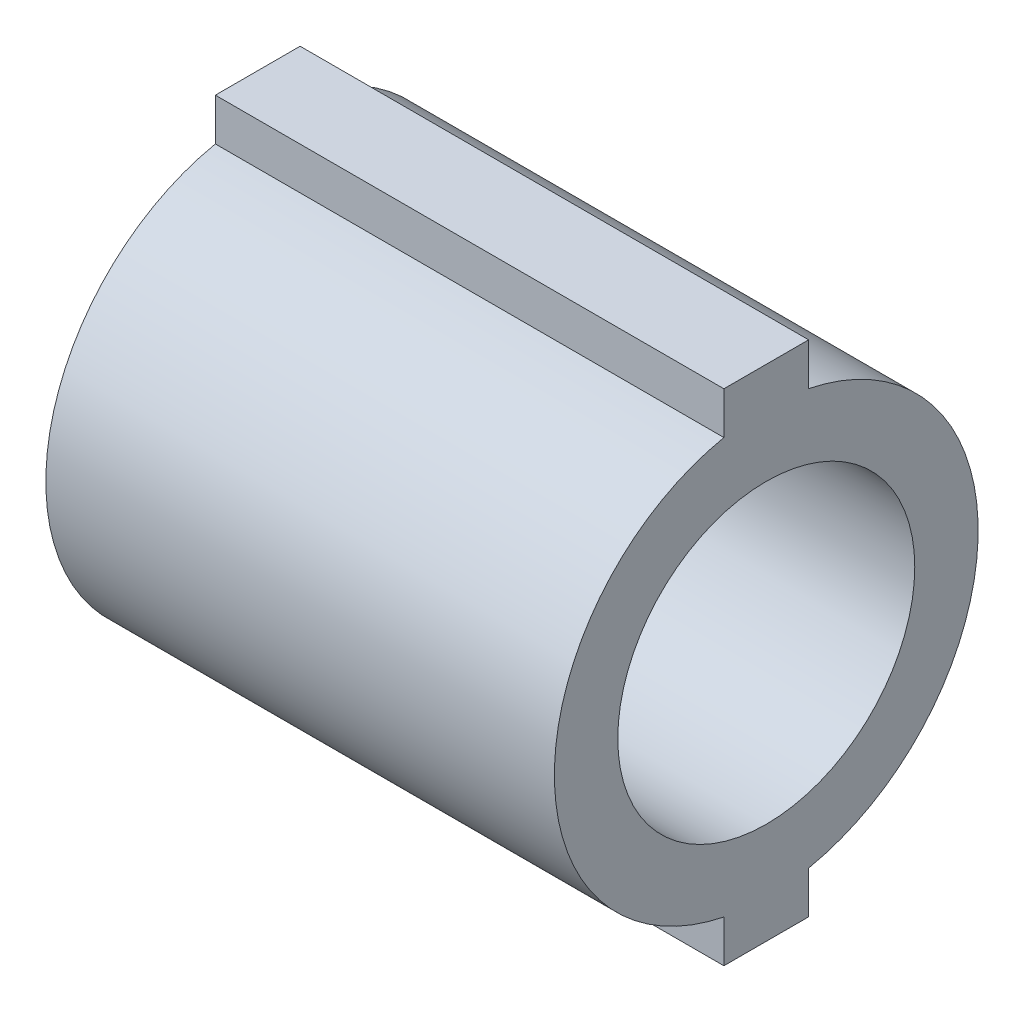
ISO-10303-21;
HEADER;
FILE_DESCRIPTION(('STEP AP214'),'2;1');
FILE_NAME('part.step','',(''),(''),'','','');
FILE_SCHEMA(('AUTOMOTIVE_DESIGN { 1 0 10303 214 1 1 1 1 }'));
ENDSEC;
DATA;
#1=APPLICATION_CONTEXT('core data for automotive mechanical design processes');
#2=APPLICATION_PROTOCOL_DEFINITION('international standard','automotive_design',2000,#1);
#3=PRODUCT_CONTEXT('',#1,'mechanical');
#4=PRODUCT('Part','Part','',(#3));
#5=PRODUCT_RELATED_PRODUCT_CATEGORY('part','',(#4));
#6=PRODUCT_DEFINITION_FORMATION('','',#4);
#7=PRODUCT_DEFINITION_CONTEXT('part definition',#1,'design');
#8=PRODUCT_DEFINITION('design','',#6,#7);
#9=PRODUCT_DEFINITION_SHAPE('','',#8);
#10=(LENGTH_UNIT() NAMED_UNIT(*) SI_UNIT(.MILLI.,.METRE.));
#11=(NAMED_UNIT(*) PLANE_ANGLE_UNIT() SI_UNIT($,.RADIAN.));
#12=(NAMED_UNIT(*) SI_UNIT($,.STERADIAN.) SOLID_ANGLE_UNIT());
#13=UNCERTAINTY_MEASURE_WITH_UNIT(LENGTH_MEASURE(1.E-05),#10,'distance_accuracy_value','');
#14=(GEOMETRIC_REPRESENTATION_CONTEXT(3) GLOBAL_UNCERTAINTY_ASSIGNED_CONTEXT((#13)) GLOBAL_UNIT_ASSIGNED_CONTEXT((#10,
#11,#12)) REPRESENTATION_CONTEXT('',''));
#15=CARTESIAN_POINT('',(0.,0.,0.));
#16=DIRECTION('',(0.,0.,1.));
#17=DIRECTION('',(1.,0.,0.));
#18=AXIS2_PLACEMENT_3D('',#15,#16,#17);
#19=CARTESIAN_POINT('',(19.05,0.,0.));
#20=DIRECTION('',(-1.,0.,0.));
#21=DIRECTION('',(0.,0.,1.));
#22=AXIS2_PLACEMENT_3D('',#19,#20,#21);
#23=CYLINDRICAL_SURFACE('',#22,7.9375);
#24=CARTESIAN_POINT('',(0.,0.,0.));
#25=DIRECTION('',(1.,0.,0.));
#26=DIRECTION('',(0.,0.,-1.));
#27=AXIS2_PLACEMENT_3D('',#24,#25,#26);
#28=CIRCLE('',#27,7.9375);
#29=CARTESIAN_POINT('',(0.,7.77712993333659,1.5875));
#30=VERTEX_POINT('',#29);
#31=CARTESIAN_POINT('',(0.,-7.77712993333659,1.5875));
#32=VERTEX_POINT('',#31);
#33=EDGE_CURVE('E37',#30,#32,#28,.T.);
#34=ORIENTED_EDGE('',*,*,#33,.T.);
#35=DIRECTION('',(-1.,0.,0.));
#36=VECTOR('',#35,1.);
#37=CARTESIAN_POINT('',(19.05,-7.77712993333659,1.5875));
#38=LINE('',#37,#36);
#39=CARTESIAN_POINT('',(19.05,-7.77712993333659,1.5875));
#40=VERTEX_POINT('',#39);
#41=EDGE_CURVE('E130',#32,#40,#38,.F.);
#42=ORIENTED_EDGE('',*,*,#41,.T.);
#43=CARTESIAN_POINT('',(19.05,0.,0.));
#44=DIRECTION('',(1.,0.,0.));
#45=DIRECTION('',(0.,0.,-1.));
#46=AXIS2_PLACEMENT_3D('',#43,#44,#45);
#47=CIRCLE('',#46,7.9375);
#48=CARTESIAN_POINT('',(19.05,7.77712993333659,1.5875));
#49=VERTEX_POINT('',#48);
#50=EDGE_CURVE('E11',#49,#40,#47,.T.);
#51=ORIENTED_EDGE('',*,*,#50,.F.);
#52=DIRECTION('',(-1.,0.,0.));
#53=VECTOR('',#52,1.);
#54=CARTESIAN_POINT('',(19.05,7.77712993333659,1.5875));
#55=LINE('',#54,#53);
#56=EDGE_CURVE('E155',#49,#30,#55,.T.);
#57=ORIENTED_EDGE('',*,*,#56,.T.);
#58=EDGE_LOOP('',(#34,#42,#51,#57));
#59=FACE_BOUND('',#58,.T.);
#60=ADVANCED_FACE('F33',(#59),#23,.T.);
#61=CARTESIAN_POINT('',(19.05,-7.77712993333659,-1.5875));
#62=VERTEX_POINT('',#61);
#63=CARTESIAN_POINT('',(19.05,7.77712993333659,-1.5875));
#64=VERTEX_POINT('',#63);
#65=EDGE_CURVE('E42',#62,#64,#47,.T.);
#66=ORIENTED_EDGE('',*,*,#65,.F.);
#67=DIRECTION('',(-1.,0.,0.));
#68=VECTOR('',#67,1.);
#69=CARTESIAN_POINT('',(19.05,-7.77712993333659,-1.5875));
#70=LINE('',#69,#68);
#71=CARTESIAN_POINT('',(0.,-7.77712993333659,-1.5875));
#72=VERTEX_POINT('',#71);
#73=EDGE_CURVE('E128',#62,#72,#70,.T.);
#74=ORIENTED_EDGE('',*,*,#73,.T.);
#75=CARTESIAN_POINT('',(0.,7.77712993333659,-1.5875));
#76=VERTEX_POINT('',#75);
#77=EDGE_CURVE('E157',#72,#76,#28,.T.);
#78=ORIENTED_EDGE('',*,*,#77,.T.);
#79=DIRECTION('',(-1.,0.,0.));
#80=VECTOR('',#79,1.);
#81=CARTESIAN_POINT('',(19.05,7.77712993333659,-1.5875));
#82=LINE('',#81,#80);
#83=EDGE_CURVE('E143',#76,#64,#82,.F.);
#84=ORIENTED_EDGE('',*,*,#83,.T.);
#85=EDGE_LOOP('',(#66,#74,#78,#84));
#86=FACE_BOUND('',#85,.T.);
#87=ADVANCED_FACE('F35',(#86),#23,.T.);
#88=CARTESIAN_POINT('',(19.05,0.,0.));
#89=DIRECTION('',(1.,0.,0.));
#90=DIRECTION('',(0.,0.,-1.));
#91=AXIS2_PLACEMENT_3D('',#88,#89,#90);
#92=PLANE('',#91);
#93=CARTESIAN_POINT('',(19.05,0.,0.));
#94=DIRECTION('',(1.,0.,0.));
#95=DIRECTION('',(0.,0.,-1.));
#96=AXIS2_PLACEMENT_3D('',#93,#94,#95);
#97=CIRCLE('',#96,5.5626);
#98=CARTESIAN_POINT('',(19.05,0.,-5.5626));
#99=VERTEX_POINT('',#98);
#100=EDGE_CURVE('E166',#99,#99,#97,.F.);
#101=ORIENTED_EDGE('',*,*,#100,.T.);
#102=EDGE_LOOP('',(#101));
#103=FACE_BOUND('',#102,.T.);
#104=ORIENTED_EDGE('',*,*,#50,.T.);
#105=DIRECTION('',(0.,1.,0.));
#106=VECTOR('',#105,1.);
#107=CARTESIAN_POINT('',(19.05,-5.91298430114647,1.5875));
#108=LINE('',#107,#106);
#109=CARTESIAN_POINT('',(19.05,-9.3599,1.5875));
#110=VERTEX_POINT('',#109);
#111=EDGE_CURVE('E97',#110,#40,#108,.T.);
#112=ORIENTED_EDGE('',*,*,#111,.F.);
#113=DIRECTION('',(0.,0.,1.));
#114=VECTOR('',#113,1.);
#115=CARTESIAN_POINT('',(19.05,-9.3599,-1.5875));
#116=LINE('',#115,#114);
#117=CARTESIAN_POINT('',(19.05,-9.3599,-1.5875));
#118=VERTEX_POINT('',#117);
#119=EDGE_CURVE('E101',#118,#110,#116,.T.);
#120=ORIENTED_EDGE('',*,*,#119,.F.);
#121=DIRECTION('',(0.,-1.,0.));
#122=VECTOR('',#121,1.);
#123=CARTESIAN_POINT('',(19.05,-5.91298430114647,-1.5875));
#124=LINE('',#123,#122);
#125=EDGE_CURVE('E107',#62,#118,#124,.T.);
#126=ORIENTED_EDGE('',*,*,#125,.F.);
#127=ORIENTED_EDGE('',*,*,#65,.T.);
#128=DIRECTION('',(0.,-1.,0.));
#129=VECTOR('',#128,1.);
#130=CARTESIAN_POINT('',(19.05,5.91298430114647,-1.5875));
#131=LINE('',#130,#129);
#132=CARTESIAN_POINT('',(19.05,9.3599,-1.5875));
#133=VERTEX_POINT('',#132);
#134=EDGE_CURVE('E141',#133,#64,#131,.T.);
#135=ORIENTED_EDGE('',*,*,#134,.F.);
#136=DIRECTION('',(0.,0.,-1.));
#137=VECTOR('',#136,1.);
#138=CARTESIAN_POINT('',(19.05,9.3599,-1.5875));
#139=LINE('',#138,#137);
#140=CARTESIAN_POINT('',(19.05,9.3599,1.5875));
#141=VERTEX_POINT('',#140);
#142=EDGE_CURVE('E145',#141,#133,#139,.T.);
#143=ORIENTED_EDGE('',*,*,#142,.F.);
#144=DIRECTION('',(0.,1.,0.));
#145=VECTOR('',#144,1.);
#146=CARTESIAN_POINT('',(19.05,5.91298430114647,1.5875));
#147=LINE('',#146,#145);
#148=EDGE_CURVE('E136',#49,#141,#147,.T.);
#149=ORIENTED_EDGE('',*,*,#148,.F.);
#150=EDGE_LOOP('',(#104,#112,#120,#126,#127,#135,#143,#149));
#151=FACE_BOUND('',#150,.T.);
#152=ADVANCED_FACE('F99',(#103,#151),#92,.T.);
#153=CARTESIAN_POINT('',(0.,0.,0.));
#154=DIRECTION('',(1.,0.,0.));
#155=DIRECTION('',(0.,0.,-1.));
#156=AXIS2_PLACEMENT_3D('',#153,#154,#155);
#157=PLANE('',#156);
#158=CARTESIAN_POINT('',(0.,0.,0.));
#159=DIRECTION('',(-1.,0.,0.));
#160=DIRECTION('',(0.,0.,1.));
#161=AXIS2_PLACEMENT_3D('',#158,#159,#160);
#162=CIRCLE('',#161,5.5626);
#163=CARTESIAN_POINT('',(0.,0.,5.5626));
#164=VERTEX_POINT('',#163);
#165=EDGE_CURVE('E170',#164,#164,#162,.T.);
#166=ORIENTED_EDGE('',*,*,#165,.F.);
#167=EDGE_LOOP('',(#166));
#168=FACE_BOUND('',#167,.T.);
#169=ORIENTED_EDGE('',*,*,#77,.F.);
#170=DIRECTION('',(0.,-1.,0.));
#171=VECTOR('',#170,1.);
#172=CARTESIAN_POINT('',(0.,-5.91298430114647,-1.5875));
#173=LINE('',#172,#171);
#174=CARTESIAN_POINT('',(0.,-9.3599,-1.5875));
#175=VERTEX_POINT('',#174);
#176=EDGE_CURVE('E49',#72,#175,#173,.T.);
#177=ORIENTED_EDGE('',*,*,#176,.T.);
#178=DIRECTION('',(0.,0.,1.));
#179=VECTOR('',#178,1.);
#180=CARTESIAN_POINT('',(0.,-9.3599,-1.5875));
#181=LINE('',#180,#179);
#182=CARTESIAN_POINT('',(0.,-9.3599,1.5875));
#183=VERTEX_POINT('',#182);
#184=EDGE_CURVE('E121',#175,#183,#181,.T.);
#185=ORIENTED_EDGE('',*,*,#184,.T.);
#186=DIRECTION('',(0.,1.,0.));
#187=VECTOR('',#186,1.);
#188=CARTESIAN_POINT('',(0.,-5.91298430114647,1.5875));
#189=LINE('',#188,#187);
#190=EDGE_CURVE('E113',#183,#32,#189,.T.);
#191=ORIENTED_EDGE('',*,*,#190,.T.);
#192=ORIENTED_EDGE('',*,*,#33,.F.);
#193=DIRECTION('',(0.,1.,0.));
#194=VECTOR('',#193,1.);
#195=CARTESIAN_POINT('',(0.,5.91298430114647,1.5875));
#196=LINE('',#195,#194);
#197=CARTESIAN_POINT('',(0.,9.3599,1.5875));
#198=VERTEX_POINT('',#197);
#199=EDGE_CURVE('E137',#30,#198,#196,.T.);
#200=ORIENTED_EDGE('',*,*,#199,.T.);
#201=DIRECTION('',(0.,0.,-1.));
#202=VECTOR('',#201,1.);
#203=CARTESIAN_POINT('',(0.,9.3599,-1.5875));
#204=LINE('',#203,#202);
#205=CARTESIAN_POINT('',(0.,9.3599,-1.5875));
#206=VERTEX_POINT('',#205);
#207=EDGE_CURVE('E133',#198,#206,#204,.T.);
#208=ORIENTED_EDGE('',*,*,#207,.T.);
#209=DIRECTION('',(0.,-1.,0.));
#210=VECTOR('',#209,1.);
#211=CARTESIAN_POINT('',(0.,5.91298430114647,-1.5875));
#212=LINE('',#211,#210);
#213=EDGE_CURVE('E132',#206,#76,#212,.T.);
#214=ORIENTED_EDGE('',*,*,#213,.T.);
#215=EDGE_LOOP('',(#169,#177,#185,#191,#192,#200,#208,#214));
#216=FACE_BOUND('',#215,.T.);
#217=ADVANCED_FACE('F165',(#168,#216),#157,.F.);
#218=CARTESIAN_POINT('',(23.7363474940515,5.91298430114647,1.5875));
#219=DIRECTION('',(0.,0.,1.));
#220=DIRECTION('',(1.,0.,0.));
#221=AXIS2_PLACEMENT_3D('',#218,#219,#220);
#222=PLANE('',#221);
#223=ORIENTED_EDGE('',*,*,#56,.F.);
#224=ORIENTED_EDGE('',*,*,#148,.T.);
#225=DIRECTION('',(-1.,0.,0.));
#226=VECTOR('',#225,1.);
#227=CARTESIAN_POINT('',(23.7363474940515,9.3599,1.5875));
#228=LINE('',#227,#226);
#229=EDGE_CURVE('E148',#141,#198,#228,.T.);
#230=ORIENTED_EDGE('',*,*,#229,.T.);
#231=ORIENTED_EDGE('',*,*,#199,.F.);
#232=EDGE_LOOP('',(#223,#224,#230,#231));
#233=FACE_BOUND('',#232,.T.);
#234=ADVANCED_FACE('F178',(#233),#222,.T.);
#235=CARTESIAN_POINT('',(23.7363474940515,5.91298430114647,-1.5875));
#236=DIRECTION('',(0.,0.,-1.));
#237=DIRECTION('',(-1.,0.,0.));
#238=AXIS2_PLACEMENT_3D('',#235,#236,#237);
#239=PLANE('',#238);
#240=ORIENTED_EDGE('',*,*,#83,.F.);
#241=ORIENTED_EDGE('',*,*,#213,.F.);
#242=DIRECTION('',(-1.,0.,0.));
#243=VECTOR('',#242,1.);
#244=CARTESIAN_POINT('',(23.7363474940515,9.3599,-1.5875));
#245=LINE('',#244,#243);
#246=EDGE_CURVE('E144',#133,#206,#245,.T.);
#247=ORIENTED_EDGE('',*,*,#246,.F.);
#248=ORIENTED_EDGE('',*,*,#134,.T.);
#249=EDGE_LOOP('',(#240,#241,#247,#248));
#250=FACE_BOUND('',#249,.T.);
#251=ADVANCED_FACE('F183',(#250),#239,.T.);
#252=CARTESIAN_POINT('',(23.7363474940515,9.3599,-1.5875));
#253=DIRECTION('',(0.,1.,0.));
#254=DIRECTION('',(0.,0.,1.));
#255=AXIS2_PLACEMENT_3D('',#252,#253,#254);
#256=PLANE('',#255);
#257=ORIENTED_EDGE('',*,*,#229,.F.);
#258=ORIENTED_EDGE('',*,*,#142,.T.);
#259=ORIENTED_EDGE('',*,*,#246,.T.);
#260=ORIENTED_EDGE('',*,*,#207,.F.);
#261=EDGE_LOOP('',(#257,#258,#259,#260));
#262=FACE_BOUND('',#261,.T.);
#263=ADVANCED_FACE('F200',(#262),#256,.T.);
#264=CARTESIAN_POINT('',(23.7363474940515,-5.91298430114647,1.5875));
#265=DIRECTION('',(0.,0.,1.));
#266=DIRECTION('',(0.,-1.,0.));
#267=AXIS2_PLACEMENT_3D('',#264,#265,#266);
#268=PLANE('',#267);
#269=ORIENTED_EDGE('',*,*,#41,.F.);
#270=ORIENTED_EDGE('',*,*,#190,.F.);
#271=DIRECTION('',(-1.,0.,0.));
#272=VECTOR('',#271,1.);
#273=CARTESIAN_POINT('',(23.7363474940515,-9.3599,1.5875));
#274=LINE('',#273,#272);
#275=EDGE_CURVE('E108',#110,#183,#274,.T.);
#276=ORIENTED_EDGE('',*,*,#275,.F.);
#277=ORIENTED_EDGE('',*,*,#111,.T.);
#278=EDGE_LOOP('',(#269,#270,#276,#277));
#279=FACE_BOUND('',#278,.T.);
#280=ADVANCED_FACE('F111',(#279),#268,.T.);
#281=CARTESIAN_POINT('',(23.7363474940515,-5.91298430114647,-1.5875));
#282=DIRECTION('',(0.,0.,-1.));
#283=DIRECTION('',(0.,1.,0.));
#284=AXIS2_PLACEMENT_3D('',#281,#282,#283);
#285=PLANE('',#284);
#286=ORIENTED_EDGE('',*,*,#73,.F.);
#287=ORIENTED_EDGE('',*,*,#125,.T.);
#288=DIRECTION('',(-1.,0.,0.));
#289=VECTOR('',#288,1.);
#290=CARTESIAN_POINT('',(23.7363474940515,-9.3599,-1.5875));
#291=LINE('',#290,#289);
#292=EDGE_CURVE('E119',#118,#175,#291,.T.);
#293=ORIENTED_EDGE('',*,*,#292,.T.);
#294=ORIENTED_EDGE('',*,*,#176,.F.);
#295=EDGE_LOOP('',(#286,#287,#293,#294));
#296=FACE_BOUND('',#295,.T.);
#297=ADVANCED_FACE('F208',(#296),#285,.T.);
#298=CARTESIAN_POINT('',(23.7363474940515,-9.3599,-1.5875));
#299=DIRECTION('',(0.,-1.,0.));
#300=DIRECTION('',(0.,0.,-1.));
#301=AXIS2_PLACEMENT_3D('',#298,#299,#300);
#302=PLANE('',#301);
#303=ORIENTED_EDGE('',*,*,#292,.F.);
#304=ORIENTED_EDGE('',*,*,#119,.T.);
#305=ORIENTED_EDGE('',*,*,#275,.T.);
#306=ORIENTED_EDGE('',*,*,#184,.F.);
#307=EDGE_LOOP('',(#303,#304,#305,#306));
#308=FACE_BOUND('',#307,.T.);
#309=ADVANCED_FACE('F118',(#308),#302,.T.);
#310=CARTESIAN_POINT('',(34.7834087241132,0.,0.));
#311=DIRECTION('',(-1.,0.,0.));
#312=DIRECTION('',(0.,0.,1.));
#313=AXIS2_PLACEMENT_3D('',#310,#311,#312);
#314=CYLINDRICAL_SURFACE('',#313,5.5626);
#315=ORIENTED_EDGE('',*,*,#165,.T.);
#316=EDGE_LOOP('',(#315));
#317=FACE_BOUND('',#316,.T.);
#318=ORIENTED_EDGE('',*,*,#100,.F.);
#319=EDGE_LOOP('',(#318));
#320=FACE_BOUND('',#319,.T.);
#321=ADVANCED_FACE('F174',(#317,#320),#314,.F.);
#322=CLOSED_SHELL('',(#60,#87,#152,#217,#234,#251,#263,#280,#297,#309,#321));
#323=MANIFOLD_SOLID_BREP('B2',#322);
#324=ADVANCED_BREP_SHAPE_REPRESENTATION('',(#18,#323),#14);
#325=SHAPE_DEFINITION_REPRESENTATION(#9,#324);
ENDSEC;
END-ISO-10303-21;
